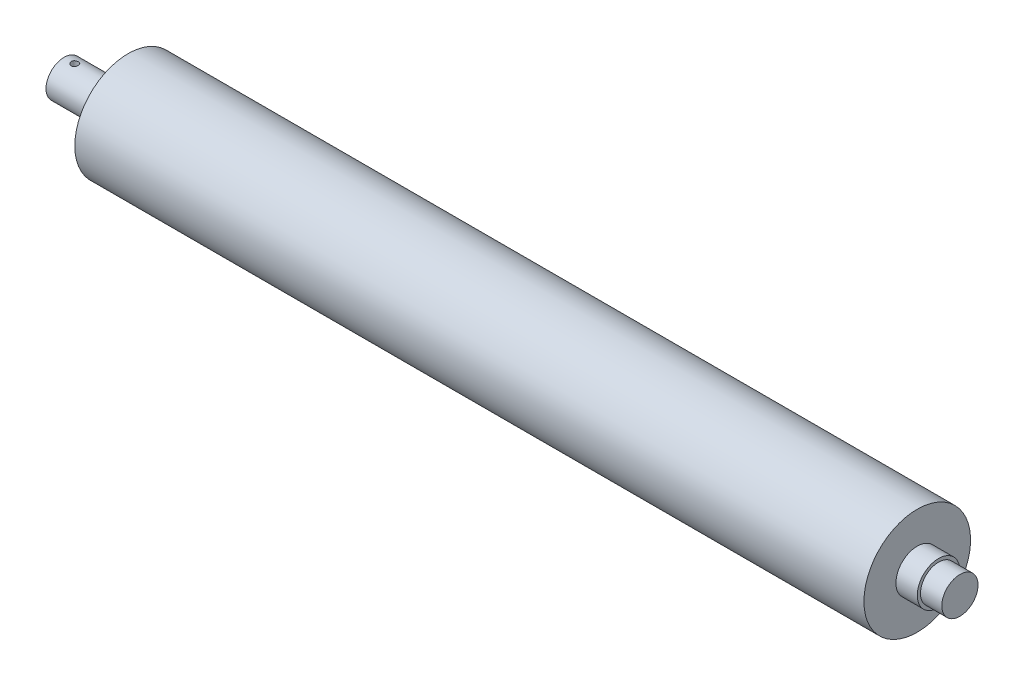
ISO-10303-21;
HEADER;
FILE_DESCRIPTION(('STEP AP214'),'2;1');
FILE_NAME('part.step','',(''),(''),'','','');
FILE_SCHEMA(('AUTOMOTIVE_DESIGN { 1 0 10303 214 1 1 1 1 }'));
ENDSEC;
DATA;
#1=APPLICATION_CONTEXT('core data for automotive mechanical design processes');
#2=APPLICATION_PROTOCOL_DEFINITION('international standard','automotive_design',2000,#1);
#3=PRODUCT_CONTEXT('',#1,'mechanical');
#4=PRODUCT('Part','Part','',(#3));
#5=PRODUCT_RELATED_PRODUCT_CATEGORY('part','',(#4));
#6=PRODUCT_DEFINITION_FORMATION('','',#4);
#7=PRODUCT_DEFINITION_CONTEXT('part definition',#1,'design');
#8=PRODUCT_DEFINITION('design','',#6,#7);
#9=PRODUCT_DEFINITION_SHAPE('','',#8);
#10=(LENGTH_UNIT() NAMED_UNIT(*) SI_UNIT(.MILLI.,.METRE.));
#11=(NAMED_UNIT(*) PLANE_ANGLE_UNIT() SI_UNIT($,.RADIAN.));
#12=(NAMED_UNIT(*) SI_UNIT($,.STERADIAN.) SOLID_ANGLE_UNIT());
#13=UNCERTAINTY_MEASURE_WITH_UNIT(LENGTH_MEASURE(1.E-05),#10,'distance_accuracy_value','');
#14=(GEOMETRIC_REPRESENTATION_CONTEXT(3) GLOBAL_UNCERTAINTY_ASSIGNED_CONTEXT((#13)) GLOBAL_UNIT_ASSIGNED_CONTEXT((#10,
#11,#12)) REPRESENTATION_CONTEXT('',''));
#15=CARTESIAN_POINT('',(0.,0.,0.));
#16=DIRECTION('',(0.,0.,1.));
#17=DIRECTION('',(1.,0.,0.));
#18=AXIS2_PLACEMENT_3D('',#15,#16,#17);
#19=CARTESIAN_POINT('',(-50.4921454977943,8.5,0.));
#20=DIRECTION('',(0.,1.,0.));
#21=DIRECTION('',(0.,0.,1.));
#22=AXIS2_PLACEMENT_3D('',#19,#20,#21);
#23=CYLINDRICAL_SURFACE('',#22,1.65);
#24=CARTESIAN_POINT('',(-50.4921454977943,-5.82065288434209,1.65));
#25=CARTESIAN_POINT('',(-50.4013334016638,-5.82065437726566,1.64999797266733));
#26=CARTESIAN_POINT('',(-50.3105001768433,-5.82280135853154,1.64247733745391));
#27=CARTESIAN_POINT('',(-50.1314626199643,-5.83113016096071,1.61265401651665));
#28=CARTESIAN_POINT('',(-50.0432595487459,-5.83731388574315,1.59034435661168));
#29=CARTESIAN_POINT('',(-49.8720983910363,-5.85296489134644,1.53173542085026));
#30=CARTESIAN_POINT('',(-49.7891329007997,-5.86242740862024,1.49545643167453));
#31=CARTESIAN_POINT('',(-49.630451550134,-5.88356367643304,1.41000281425575));
#32=CARTESIAN_POINT('',(-49.5547363479333,-5.89523762745442,1.36082701666865));
#33=CARTESIAN_POINT('',(-49.4107242703239,-5.919823649798,1.24959984442718));
#34=CARTESIAN_POINT('',(-49.3426451365785,-5.93275846998227,1.18727151640311));
#35=CARTESIAN_POINT('',(-49.2177650742963,-5.95821281321671,1.05210382992512));
#36=CARTESIAN_POINT('',(-49.1609653607867,-5.97073229140508,0.979263340551384));
#37=CARTESIAN_POINT('',(-49.0593420083028,-5.99419999295531,0.823622351656514));
#38=CARTESIAN_POINT('',(-49.0147358037853,-6.00511825629147,0.740674971429909));
#39=CARTESIAN_POINT('',(-48.9401853427932,-6.02389174814525,0.56811008326214));
#40=CARTESIAN_POINT('',(-48.9102384957627,-6.03174751780724,0.478493757063303));
#41=CARTESIAN_POINT('',(-48.8665642896858,-6.04335001683033,0.297408597032826));
#42=CARTESIAN_POINT('',(-48.8524663091581,-6.04719048557634,0.20603526176122));
#43=CARTESIAN_POINT('',(-48.8397229652666,-6.05065782490921,0.0221450586222227));
#44=CARTESIAN_POINT('',(-48.8410749012954,-6.05028543189399,-0.0703716065698035));
#45=CARTESIAN_POINT('',(-48.8589341363076,-6.04543727043666,-0.251339066772847));
#46=CARTESIAN_POINT('',(-48.8750408584455,-6.04106996420131,-0.339832745372549));
#47=CARTESIAN_POINT('',(-48.9213040633745,-6.02885133506642,-0.512810105386387));
#48=CARTESIAN_POINT('',(-48.9514613652555,-6.02099980905269,-0.597293552704396));
#49=CARTESIAN_POINT('',(-49.0252703472217,-6.00253597767466,-0.760862560584385));
#50=CARTESIAN_POINT('',(-49.0690572913508,-5.99189617598953,-0.83988385304074));
#51=CARTESIAN_POINT('',(-49.1687782814885,-5.96899916643194,-0.989592195527098));
#52=CARTESIAN_POINT('',(-49.2247147886028,-5.95674163105699,-1.06027755248529));
#53=CARTESIAN_POINT('',(-49.3492652924273,-5.93147082876596,-1.1936988236347));
#54=CARTESIAN_POINT('',(-49.4182283369292,-5.91844593226477,-1.25610708588062));
#55=CARTESIAN_POINT('',(-49.565775234419,-5.89346118650106,-1.36855483910386));
#56=CARTESIAN_POINT('',(-49.6443597305994,-5.88150140853396,-1.41859350249975));
#57=CARTESIAN_POINT('',(-49.8096553311947,-5.85995268779351,-1.505146553973));
#58=CARTESIAN_POINT('',(-49.896417404146,-5.85038018363885,-1.54156798699972));
#59=CARTESIAN_POINT('',(-50.0751603602464,-5.83489208999369,-1.59919814789971));
#60=CARTESIAN_POINT('',(-50.1671398735905,-5.82897554546203,-1.62041084896083));
#61=CARTESIAN_POINT('',(-50.3506328974553,-5.82167382701712,-1.64644839106137));
#62=CARTESIAN_POINT('',(-50.4420715032349,-5.82015310677883,-1.65176361969819));
#63=CARTESIAN_POINT('',(-50.6245317556906,-5.82144366322467,-1.64720965872124));
#64=CARTESIAN_POINT('',(-50.7155534479293,-5.82425445463477,-1.63734217007926));
#65=CARTESIAN_POINT('',(-50.8926801788368,-5.83376002307216,-1.60313601757953));
#66=CARTESIAN_POINT('',(-50.9788475604871,-5.84037465230273,-1.57909572270319));
#67=CARTESIAN_POINT('',(-51.145926108718,-5.85666346580151,-1.51756365022384));
#68=CARTESIAN_POINT('',(-51.2268365641098,-5.86633806300616,-1.48007005703384));
#69=CARTESIAN_POINT('',(-51.383146276778,-5.88793224772797,-1.39171164856937));
#70=CARTESIAN_POINT('',(-51.4583773297498,-5.89989808748098,-1.34056084134673));
#71=CARTESIAN_POINT('',(-51.599368169718,-5.92461939007576,-1.22669185784976));
#72=CARTESIAN_POINT('',(-51.6651260869045,-5.9373750080957,-1.16397140351164));
#73=CARTESIAN_POINT('',(-51.78735849814,-5.96270801523266,-1.0264686993013));
#74=CARTESIAN_POINT('',(-51.843490001572,-5.97526819769215,-0.951377732271553));
#75=CARTESIAN_POINT('',(-51.9423531963944,-5.99839852328391,-0.792556113257567));
#76=CARTESIAN_POINT('',(-51.9850856006549,-6.00896877227431,-0.708825921219671));
#77=CARTESIAN_POINT('',(-52.0555392706781,-6.02686010547745,-0.535691571967097));
#78=CARTESIAN_POINT('',(-52.0833734771249,-6.03420555757738,-0.446336014569963));
#79=CARTESIAN_POINT('',(-52.1235631455939,-6.04492706202133,-0.263984451195097));
#80=CARTESIAN_POINT('',(-52.135922208004,-6.04830403764465,-0.170989297186196));
#81=CARTESIAN_POINT('',(-52.144576629894,-6.05066228092608,0.012803691650227));
#82=CARTESIAN_POINT('',(-52.1413740362317,-6.04978093494039,0.103576450235713));
#83=CARTESIAN_POINT('',(-52.1201677427534,-6.04403453816205,0.283240435100883));
#84=CARTESIAN_POINT('',(-52.102164644871,-6.03916964937939,0.37213173774823));
#85=CARTESIAN_POINT('',(-52.0521573904209,-6.02603224209617,0.544876237066535));
#86=CARTESIAN_POINT('',(-52.0202592297301,-6.01778554843525,0.628762212974493));
#87=CARTESIAN_POINT('',(-51.9434617141057,-5.99874485012135,0.790039106584792));
#88=CARTESIAN_POINT('',(-51.8985604728071,-5.98795047591681,0.867429079805306));
#89=CARTESIAN_POINT('',(-51.7955852966845,-5.96459366082427,1.01583754271497));
#90=CARTESIAN_POINT('',(-51.737181518114,-5.95199059126526,1.08662074753416));
#91=CARTESIAN_POINT('',(-51.6094791453891,-5.92659478123856,1.21755145812398));
#92=CARTESIAN_POINT('',(-51.540177644548,-5.91380199099462,1.27769611721632));
#93=CARTESIAN_POINT('',(-51.3907052182803,-5.88913058572092,1.38703362668079));
#94=CARTESIAN_POINT('',(-51.3103186748454,-5.87728021279129,1.43593867766728));
#95=CARTESIAN_POINT('',(-51.1421509581298,-5.8562422131557,1.51947186933332));
#96=CARTESIAN_POINT('',(-51.054374450233,-5.84705292250314,1.55410893738157));
#97=CARTESIAN_POINT('',(-50.8878506766165,-5.83359129729563,1.60382872267331));
#98=CARTESIAN_POINT('',(-50.8097941821677,-5.82877973492013,1.62110114345224));
#99=CARTESIAN_POINT('',(-50.6518789201014,-5.82231007140326,1.64418694868339));
#100=CARTESIAN_POINT('',(-50.5720203818379,-5.820651571223,1.65000178316512));
#101=CARTESIAN_POINT('',(-50.4921454977943,-5.82065288434209,1.65));
#102=B_SPLINE_CURVE_WITH_KNOTS('',3,(#24,#25,#26,#27,#28,#29,#30,#31,#32,#33,#34,#35,#36,#37,
#38,#39,#40,#41,#42,#43,#44,#45,#46,#47,#48,#49,#50,#51,#52,#53,#54,#55,#56,#57,#58,#59,#60,#61,
#62,#63,#64,#65,#66,#67,#68,#69,#70,#71,#72,#73,#74,#75,#76,#77,#78,#79,#80,#81,#82,#83,#84,#85,
#86,#87,#88,#89,#90,#91,#92,#93,#94,#95,#96,#97,#98,#99,#100,#101),.UNSPECIFIED.,.T.,.F.,(4,2,2,
2,2,2,2,2,2,2,2,2,2,2,2,2,2,2,2,2,2,2,2,2,2,2,2,2,2,2,2,2,2,2,2,2,2,2,4),(0.,0.272142421531167,
0.544413270870418,0.816290202520554,1.08819179357773,1.36652259700908,1.64488336618984,
1.92792471101544,2.21091601958311,2.48714227323167,2.76332024395223,3.0322155862423,
3.30112660596763,3.57279636684429,3.84452121057657,4.12496058552846,4.40541871805263,
4.68775782013688,4.97002313596155,5.24348672694926,5.5169196831054,5.78479206192071,
6.05270060500048,6.32673168038151,6.60081677019403,6.88323412344203,7.16563644873689,
7.44586646945045,7.72603128079755,7.99721863644499,8.26839496349792,8.53753793815438,
8.80671997712911,9.0833435593423,9.360041049309,9.643184993488,9.92615150656222,
10.1655479835946,10.4049141615528),.UNSPECIFIED.);
#103=CARTESIAN_POINT('',(-50.4921454977943,-5.82065288434209,1.65));
#104=VERTEX_POINT('',#103);
#105=EDGE_CURVE('E40',#104,#104,#102,.T.);
#106=ORIENTED_EDGE('',*,*,#105,.T.);
#107=EDGE_LOOP('',(#106));
#108=FACE_BOUND('',#107,.T.);
#109=CARTESIAN_POINT('',(-50.4921454977943,-8.33831517754036,1.65));
#110=CARTESIAN_POINT('',(-50.4004060032334,-8.33831698113515,1.64999654584405));
#111=CARTESIAN_POINT('',(-50.3086223841767,-8.33984562808622,1.64232299568276));
#112=CARTESIAN_POINT('',(-50.1276476156017,-8.34578672369094,1.6118547816225));
#113=CARTESIAN_POINT('',(-50.0384586632472,-8.35020154614159,1.58904767056989));
#114=CARTESIAN_POINT('',(-49.8653177982748,-8.36139657192924,1.52904282723213));
#115=CARTESIAN_POINT('',(-49.7813609254275,-8.36817449346442,1.49185897332863));
#116=CARTESIAN_POINT('',(-49.620880876314,-8.38332930931016,1.40419357245978));
#117=CARTESIAN_POINT('',(-49.544357206881,-8.39170609743209,1.35371290851684));
#118=CARTESIAN_POINT('',(-49.3998909628083,-8.40923952487649,1.24016959557929));
#119=CARTESIAN_POINT('',(-49.3320618751395,-8.41840428803623,1.1769637841096));
#120=CARTESIAN_POINT('',(-49.2079000277361,-8.43640940764748,1.04007371819241));
#121=CARTESIAN_POINT('',(-49.1515680491159,-8.44524974202383,0.966388752366983));
#122=CARTESIAN_POINT('',(-49.0515617196865,-8.46169727609052,0.809883405698844));
#123=CARTESIAN_POINT('',(-49.0079948126202,-8.46929378350957,0.726993148749954));
#124=CARTESIAN_POINT('',(-48.9354481258388,-8.48230663974867,0.554897288771806));
#125=CARTESIAN_POINT('',(-48.9064670603499,-8.48772318072911,0.465692243196042));
#126=CARTESIAN_POINT('',(-48.8642668849978,-8.49570841983847,0.284675958249799));
#127=CARTESIAN_POINT('',(-48.8508562893768,-8.4983116874139,0.192910910072457));
#128=CARTESIAN_POINT('',(-48.8395806801813,-8.50049633977488,0.00839893937519247));
#129=CARTESIAN_POINT('',(-48.841714251907,-8.5000779995619,-0.0843478930237897));
#130=CARTESIAN_POINT('',(-48.8613204027176,-8.49629346800802,-0.266876138201246));
#131=CARTESIAN_POINT('',(-48.8785867587345,-8.49296691012217,-0.35668064321074));
#132=CARTESIAN_POINT('',(-48.9276417004292,-8.4837842951796,-0.532092958251712));
#133=CARTESIAN_POINT('',(-48.959430842868,-8.47792814114607,-0.617700607248726));
#134=CARTESIAN_POINT('',(-49.0368226263648,-8.46427857123533,-0.782882145301342));
#135=CARTESIAN_POINT('',(-49.0825068457682,-8.45647376460302,-0.862416833091105));
#136=CARTESIAN_POINT('',(-49.18633173434,-8.43978859795565,-1.01276800571309));
#137=CARTESIAN_POINT('',(-49.2444737574475,-8.43090812108022,-1.08358354161201));
#138=CARTESIAN_POINT('',(-49.3726975773392,-8.41288167589598,-1.21570911700106));
#139=CARTESIAN_POINT('',(-49.4429598271598,-8.40373374274387,-1.27684389120401));
#140=CARTESIAN_POINT('',(-49.592830792031,-8.38634230598401,-1.3864897873232));
#141=CARTESIAN_POINT('',(-49.6724396639903,-8.37809881756435,-1.43500069726903));
#142=CARTESIAN_POINT('',(-49.8389865205909,-8.36344623555506,-1.51807723517798));
#143=CARTESIAN_POINT('',(-49.9259382979277,-8.35704069818365,-1.55261588065732));
#144=CARTESIAN_POINT('',(-50.1045635063928,-8.34684249822114,-1.60654321302851));
#145=CARTESIAN_POINT('',(-50.1962363593594,-8.34304951650001,-1.62593375033739));
#146=CARTESIAN_POINT('',(-50.380116812533,-8.3385694396991,-1.64875539263453));
#147=CARTESIAN_POINT('',(-50.4722919139398,-8.33783321457739,-1.65243897562144));
#148=CARTESIAN_POINT('',(-50.6559397897254,-8.33941832618164,-1.64442029839135));
#149=CARTESIAN_POINT('',(-50.7474126012217,-8.34173950018331,-1.63271885701324));
#150=CARTESIAN_POINT('',(-50.9262195881897,-8.34913198025222,-1.5944795198524));
#151=CARTESIAN_POINT('',(-51.0135834707284,-8.35417849398702,-1.56807530840784));
#152=CARTESIAN_POINT('',(-51.1826472581988,-8.36643148072363,-1.5013223658954));
#153=CARTESIAN_POINT('',(-51.2643467192243,-8.37363812277408,-1.46097254342549));
#154=CARTESIAN_POINT('',(-51.4208708848263,-8.38951045394444,-1.36689766709721));
#155=CARTESIAN_POINT('',(-51.4955984586043,-8.3981930294779,-1.31301390845285));
#156=CARTESIAN_POINT('',(-51.635042767909,-8.41599203300003,-1.19361344448673));
#157=CARTESIAN_POINT('',(-51.6997585344433,-8.42510850287163,-1.12809561447807));
#158=CARTESIAN_POINT('',(-51.8182927440228,-8.44290679899299,-0.986156152541234));
#159=CARTESIAN_POINT('',(-51.8719409096963,-8.45158047945517,-0.909591136547651));
#160=CARTESIAN_POINT('',(-51.9656121558562,-8.46737647548225,-0.748388224061675));
#161=CARTESIAN_POINT('',(-52.0056357864847,-8.47449885368268,-0.66375065370593));
#162=CARTESIAN_POINT('',(-52.0706704326536,-8.4863548446495,-0.489263714493164));
#163=CARTESIAN_POINT('',(-52.0957632202455,-8.49110144571434,-0.399445745153133));
#164=CARTESIAN_POINT('',(-52.1304839022612,-8.49772663424996,-0.216768885986863));
#165=CARTESIAN_POINT('',(-52.1401135463944,-8.49960554620872,-0.123910341425969));
#166=CARTESIAN_POINT('',(-52.1435700957032,-8.50027656489904,0.0605822198027712));
#167=CARTESIAN_POINT('',(-52.1376535617328,-8.49911878713466,0.152211345149112));
#168=CARTESIAN_POINT('',(-52.1107499997384,-8.49395129578558,0.333143326460724));
#169=CARTESIAN_POINT('',(-52.0897631391383,-8.48994161388417,0.422446208258011));
#170=CARTESIAN_POINT('',(-52.0334258968924,-8.47952157392228,0.596042436980435));
#171=CARTESIAN_POINT('',(-51.9981046662415,-8.47311609012788,0.680345555197925));
#172=CARTESIAN_POINT('',(-51.9141329351479,-8.45859591220442,0.841866215165835));
#173=CARTESIAN_POINT('',(-51.8654814569904,-8.45048109271323,0.919083236627552));
#174=CARTESIAN_POINT('',(-51.7553563611809,-8.4332797058631,1.06551314009846));
#175=CARTESIAN_POINT('',(-51.69369832247,-8.42418019390968,1.13458582031064));
#176=CARTESIAN_POINT('',(-51.5596911081936,-8.40611415030437,1.26149270349594));
#177=CARTESIAN_POINT('',(-51.4873394133871,-8.39714765053707,1.31932425079926));
#178=CARTESIAN_POINT('',(-51.33312863321,-8.38026411985667,1.42265582279924));
#179=CARTESIAN_POINT('',(-51.2511814188988,-8.37235852454963,1.46802626325658));
#180=CARTESIAN_POINT('',(-51.0806983024914,-8.35863054933975,1.54428259370771));
#181=CARTESIAN_POINT('',(-50.9921685818599,-8.35280624406743,1.57518187900865));
#182=CARTESIAN_POINT('',(-50.8348649443688,-8.34508778751033,1.61548885886861));
#183=CARTESIAN_POINT('',(-50.7669998553561,-8.3425634825758,1.62840785060948));
#184=CARTESIAN_POINT('',(-50.6301466438871,-8.33917652483707,1.64566458797864));
#185=CARTESIAN_POINT('',(-50.5611585561591,-8.3383138207464,1.650002598465));
#186=CARTESIAN_POINT('',(-50.4921454977943,-8.33831517754036,1.65));
#187=B_SPLINE_CURVE_WITH_KNOTS('',3,(#109,#110,#111,#112,#113,#114,#115,#116,#117,#118,#119,
#120,#121,#122,#123,#124,#125,#126,#127,#128,#129,#130,#131,#132,#133,#134,#135,#136,#137,#138,
#139,#140,#141,#142,#143,#144,#145,#146,#147,#148,#149,#150,#151,#152,#153,#154,#155,#156,#157,
#158,#159,#160,#161,#162,#163,#164,#165,#166,#167,#168,#169,#170,#171,#172,#173,#174,#175,#176,
#177,#178,#179,#180,#181,#182,#183,#184,#185,#186),.UNSPECIFIED.,.T.,.F.,(4,2,2,2,2,2,2,2,2,2,2,
2,2,2,2,2,2,2,2,2,2,2,2,2,2,2,2,2,2,2,2,2,2,2,2,2,2,2,4),(0.,0.274965859741973,
0.550158156059082,0.825085460062391,1.0999945111318,1.37818912456829,1.65640263228317,
1.93689469309254,2.21736202357957,2.49434235517784,2.7712974786621,3.04453605613445,
3.31778510964989,3.59267043854047,3.86758565768952,4.1470171225601,4.42645327913081,
4.70642652086172,4.98636555711355,5.26178739990557,5.53719458448327,5.81013759309057,
6.08310196741856,6.35943028424879,6.63578532879905,6.91611850976486,7.19644036987439,
7.47521250706604,7.75395309797953,8.02812259654215,8.30228904926175,8.57590071708917,
8.84953245849944,9.12734186132845,9.40521681589057,9.68588052782289,9.96628392578407,
10.1731394437882,10.3799885769506),.UNSPECIFIED.);
#188=CARTESIAN_POINT('',(-50.4921454977943,-8.33831517754036,1.65));
#189=VERTEX_POINT('',#188);
#190=EDGE_CURVE('E73',#189,#189,#187,.T.);
#191=ORIENTED_EDGE('',*,*,#190,.F.);
#192=EDGE_LOOP('',(#191));
#193=FACE_BOUND('',#192,.T.);
#194=ADVANCED_FACE('F36',(#108,#193),#23,.F.);
#195=CARTESIAN_POINT('',(-55.4921454977944,8.5,0.));
#196=DIRECTION('',(1.,0.,0.));
#197=DIRECTION('',(0.,0.,-1.));
#198=AXIS2_PLACEMENT_3D('',#195,#196,#197);
#199=PLANE('',#198);
#200=CARTESIAN_POINT('',(-55.4921454977944,0.,0.));
#201=DIRECTION('',(-1.,0.,0.));
#202=DIRECTION('',(0.,0.,1.));
#203=AXIS2_PLACEMENT_3D('',#200,#201,#202);
#204=CIRCLE('',#203,6.04999999999999);
#205=CARTESIAN_POINT('',(-55.4921454977944,0.,6.04999999999999));
#206=VERTEX_POINT('',#205);
#207=EDGE_CURVE('E63',#206,#206,#204,.T.);
#208=ORIENTED_EDGE('',*,*,#207,.F.);
#209=EDGE_LOOP('',(#208));
#210=FACE_BOUND('',#209,.T.);
#211=CARTESIAN_POINT('',(-55.4921454977944,0.,0.));
#212=DIRECTION('',(-1.,0.,0.));
#213=DIRECTION('',(0.,0.,1.));
#214=AXIS2_PLACEMENT_3D('',#211,#212,#213);
#215=CIRCLE('',#214,8.5);
#216=CARTESIAN_POINT('',(-55.4921454977944,0.,8.5));
#217=VERTEX_POINT('',#216);
#218=EDGE_CURVE('E49',#217,#217,#215,.T.);
#219=ORIENTED_EDGE('',*,*,#218,.T.);
#220=EDGE_LOOP('',(#219));
#221=FACE_BOUND('',#220,.T.);
#222=ADVANCED_FACE('F38',(#210,#221),#199,.F.);
#223=CARTESIAN_POINT('',(-62.7058823529411,0.,0.));
#224=DIRECTION('',(-1.,0.,0.));
#225=DIRECTION('',(0.,0.,1.));
#226=AXIS2_PLACEMENT_3D('',#223,#224,#225);
#227=CYLINDRICAL_SURFACE('',#226,8.5);
#228=ORIENTED_EDGE('',*,*,#190,.T.);
#229=EDGE_LOOP('',(#228));
#230=FACE_BOUND('',#229,.T.);
#231=CARTESIAN_POINT('',(-50.4921454977943,8.33831517754036,1.65));
#232=CARTESIAN_POINT('',(-50.5838849923553,8.33831698113515,1.64999654584405));
#233=CARTESIAN_POINT('',(-50.675668611412,8.33984562808622,1.64232299568276));
#234=CARTESIAN_POINT('',(-50.856643379987,8.34578672369094,1.6118547816225));
#235=CARTESIAN_POINT('',(-50.9458323323415,8.35020154614159,1.58904767056989));
#236=CARTESIAN_POINT('',(-51.1189731973139,8.36139657192924,1.52904282723213));
#237=CARTESIAN_POINT('',(-51.2029300701612,8.36817449346442,1.49185897332863));
#238=CARTESIAN_POINT('',(-51.3634101192747,8.38332930931016,1.40419357245978));
#239=CARTESIAN_POINT('',(-51.4399337887077,8.39170609743209,1.35371290851684));
#240=CARTESIAN_POINT('',(-51.5844000327804,8.40923952487649,1.24016959557929));
#241=CARTESIAN_POINT('',(-51.6522291204492,8.41840428803623,1.1769637841096));
#242=CARTESIAN_POINT('',(-51.7763909678526,8.43640940764748,1.04007371819241));
#243=CARTESIAN_POINT('',(-51.8327229464728,8.44524974202383,0.966388752366983));
#244=CARTESIAN_POINT('',(-51.9327292759022,8.46169727609052,0.809883405698842));
#245=CARTESIAN_POINT('',(-51.9762961829685,8.46929378350957,0.726993148749949));
#246=CARTESIAN_POINT('',(-52.0488428697499,8.48230663974867,0.554897288771801));
#247=CARTESIAN_POINT('',(-52.0778239352388,8.48772318072911,0.46569224319604));
#248=CARTESIAN_POINT('',(-52.1200241105909,8.49570841983847,0.284675958249799));
#249=CARTESIAN_POINT('',(-52.1334347062119,8.4983116874139,0.192910910072457));
#250=CARTESIAN_POINT('',(-52.1447103154074,8.50049633977488,0.0083989393751924));
#251=CARTESIAN_POINT('',(-52.1425767436817,8.5000779995619,-0.0843478930237897));
#252=CARTESIAN_POINT('',(-52.1229705928711,8.49629346800802,-0.266876138201246));
#253=CARTESIAN_POINT('',(-52.1057042368542,8.49296691012217,-0.35668064321074));
#254=CARTESIAN_POINT('',(-52.0566492951595,8.4837842951796,-0.532092958251712));
#255=CARTESIAN_POINT('',(-52.0248601527207,8.47792814114607,-0.617700607248726));
#256=CARTESIAN_POINT('',(-51.9474683692239,8.46427857123533,-0.782882145301341));
#257=CARTESIAN_POINT('',(-51.9017841498205,8.45647376460302,-0.862416833091103));
#258=CARTESIAN_POINT('',(-51.7979592612487,8.43978859795565,-1.01276800571309));
#259=CARTESIAN_POINT('',(-51.7398172381411,8.43090812108022,-1.08358354161201));
#260=CARTESIAN_POINT('',(-51.6115934182495,8.41288167589598,-1.21570911700106));
#261=CARTESIAN_POINT('',(-51.5413311684289,8.40373374274387,-1.27684389120401));
#262=CARTESIAN_POINT('',(-51.3914602035577,8.38634230598401,-1.3864897873232));
#263=CARTESIAN_POINT('',(-51.3118513315984,8.37809881756435,-1.43500069726903));
#264=CARTESIAN_POINT('',(-51.1453044749978,8.36344623555506,-1.51807723517797));
#265=CARTESIAN_POINT('',(-51.058352697661,8.35704069818365,-1.55261588065732));
#266=CARTESIAN_POINT('',(-50.8797274891959,8.34684249822114,-1.60654321302851));
#267=CARTESIAN_POINT('',(-50.7880546362293,8.34304951650001,-1.62593375033739));
#268=CARTESIAN_POINT('',(-50.6041741830557,8.3385694396991,-1.64875539263453));
#269=CARTESIAN_POINT('',(-50.5119990816489,8.33783321457739,-1.65243897562144));
#270=CARTESIAN_POINT('',(-50.3283512058633,8.33941832618164,-1.64442029839135));
#271=CARTESIAN_POINT('',(-50.236878394367,8.34173950018331,-1.63271885701324));
#272=CARTESIAN_POINT('',(-50.058071407399,8.34913198025222,-1.5944795198524));
#273=CARTESIAN_POINT('',(-49.9707075248603,8.35417849398702,-1.56807530840784));
#274=CARTESIAN_POINT('',(-49.8016437373899,8.36643148072363,-1.5013223658954));
#275=CARTESIAN_POINT('',(-49.7199442763644,8.37363812277408,-1.46097254342549));
#276=CARTESIAN_POINT('',(-49.5634201107624,8.38951045394444,-1.36689766709721));
#277=CARTESIAN_POINT('',(-49.4886925369844,8.3981930294779,-1.31301390845285));
#278=CARTESIAN_POINT('',(-49.3492482276797,8.41599203300003,-1.19361344448673));
#279=CARTESIAN_POINT('',(-49.2845324611454,8.42510850287163,-1.12809561447807));
#280=CARTESIAN_POINT('',(-49.1659982515659,8.44290679899299,-0.986156152541234));
#281=CARTESIAN_POINT('',(-49.1123500858923,8.45158047945517,-0.909591136547648));
#282=CARTESIAN_POINT('',(-49.0186788397325,8.46737647548225,-0.748388224061672));
#283=CARTESIAN_POINT('',(-48.978655209104,8.47449885368268,-0.663750653705929));
#284=CARTESIAN_POINT('',(-48.9136205629351,8.4863548446495,-0.489263714493165));
#285=CARTESIAN_POINT('',(-48.8885277753432,8.49110144571434,-0.399445745153133));
#286=CARTESIAN_POINT('',(-48.8538070933275,8.49772663424996,-0.216768885986863));
#287=CARTESIAN_POINT('',(-48.8441774491943,8.49960554620872,-0.123910341425969));
#288=CARTESIAN_POINT('',(-48.8407208998855,8.50027656489904,0.0605822198027713));
#289=CARTESIAN_POINT('',(-48.8466374338559,8.49911878713466,0.152211345149112));
#290=CARTESIAN_POINT('',(-48.8735409958503,8.49395129578558,0.333143326460723));
#291=CARTESIAN_POINT('',(-48.8945278564504,8.48994161388417,0.422446208258011));
#292=CARTESIAN_POINT('',(-48.9508650986963,8.47952157392228,0.596042436980432));
#293=CARTESIAN_POINT('',(-48.9861863293472,8.47311609012787,0.68034555519792));
#294=CARTESIAN_POINT('',(-49.0701580604408,8.45859591220442,0.84186621516583));
#295=CARTESIAN_POINT('',(-49.1188095385983,8.45048109271323,0.919083236627549));
#296=CARTESIAN_POINT('',(-49.2289346344078,8.4332797058631,1.06551314009846));
#297=CARTESIAN_POINT('',(-49.2905926731187,8.42418019390968,1.13458582031064));
#298=CARTESIAN_POINT('',(-49.4245998873951,8.40611415030437,1.26149270349594));
#299=CARTESIAN_POINT('',(-49.4969515822016,8.39714765053707,1.31932425079926));
#300=CARTESIAN_POINT('',(-49.6511623623787,8.38026411985667,1.42265582279924));
#301=CARTESIAN_POINT('',(-49.7331095766899,8.37235852454963,1.46802626325658));
#302=CARTESIAN_POINT('',(-49.9035926930973,8.35863054933975,1.54428259370771));
#303=CARTESIAN_POINT('',(-49.9921224137288,8.35280624406743,1.57518187900865));
#304=CARTESIAN_POINT('',(-50.1494260512199,8.34508778751033,1.61548885886861));
#305=CARTESIAN_POINT('',(-50.2172911402326,8.3425634825758,1.62840785060948));
#306=CARTESIAN_POINT('',(-50.3541443517016,8.33917652483707,1.64566458797864));
#307=CARTESIAN_POINT('',(-50.4231324394296,8.3383138207464,1.650002598465));
#308=CARTESIAN_POINT('',(-50.4921454977943,8.33831517754036,1.65));
#309=B_SPLINE_CURVE_WITH_KNOTS('',3,(#231,#232,#233,#234,#235,#236,#237,#238,#239,#240,#241,
#242,#243,#244,#245,#246,#247,#248,#249,#250,#251,#252,#253,#254,#255,#256,#257,#258,#259,#260,
#261,#262,#263,#264,#265,#266,#267,#268,#269,#270,#271,#272,#273,#274,#275,#276,#277,#278,#279,
#280,#281,#282,#283,#284,#285,#286,#287,#288,#289,#290,#291,#292,#293,#294,#295,#296,#297,#298,
#299,#300,#301,#302,#303,#304,#305,#306,#307,#308),.UNSPECIFIED.,.T.,.F.,(4,2,2,2,2,2,2,2,2,2,2,
2,2,2,2,2,2,2,2,2,2,2,2,2,2,2,2,2,2,2,2,2,2,2,2,2,2,2,4),(0.,0.274965859741973,
0.550158156059082,0.825085460062391,1.0999945111318,1.37818912456829,1.65640263228317,
1.93689469309255,2.21736202357957,2.49434235517784,2.7712974786621,3.04453605613445,
3.31778510964989,3.59267043854047,3.86758565768952,4.14701712256009,4.42645327913081,
4.70642652086171,4.98636555711355,5.26178739990558,5.53719458448327,5.81013759309057,
6.08310196741856,6.35943028424879,6.63578532879905,6.91611850976486,7.19644036987439,
7.47521250706604,7.75395309797953,8.02812259654215,8.30228904926175,8.57590071708916,
8.84953245849944,9.12734186132845,9.40521681589057,9.68588052782289,9.96628392578407,
10.1731394437882,10.3799885769506),.UNSPECIFIED.);
#310=CARTESIAN_POINT('',(-50.4921454977943,8.33831517754036,1.65));
#311=VERTEX_POINT('',#310);
#312=EDGE_CURVE('E11',#311,#311,#309,.T.);
#313=ORIENTED_EDGE('',*,*,#312,.T.);
#314=EDGE_LOOP('',(#313));
#315=FACE_BOUND('',#314,.T.);
#316=ORIENTED_EDGE('',*,*,#218,.F.);
#317=EDGE_LOOP('',(#316));
#318=FACE_BOUND('',#317,.T.);
#319=CARTESIAN_POINT('',(-35.4921454977943,0.,0.));
#320=DIRECTION('',(-1.,0.,0.));
#321=DIRECTION('',(0.,0.,1.));
#322=AXIS2_PLACEMENT_3D('',#319,#320,#321);
#323=CIRCLE('',#322,8.5);
#324=CARTESIAN_POINT('',(-35.4921454977943,0.,8.5));
#325=VERTEX_POINT('',#324);
#326=EDGE_CURVE('E94',#325,#325,#323,.T.);
#327=ORIENTED_EDGE('',*,*,#326,.T.);
#328=EDGE_LOOP('',(#327));
#329=FACE_BOUND('',#328,.T.);
#330=ADVANCED_FACE('F105',(#230,#315,#318,#329),#227,.T.);
#331=CARTESIAN_POINT('',(-35.4921454977943,9.99999999999995,0.));
#332=DIRECTION('',(1.,0.,0.));
#333=DIRECTION('',(0.,0.,-1.));
#334=AXIS2_PLACEMENT_3D('',#331,#332,#333);
#335=PLANE('',#334);
#336=ORIENTED_EDGE('',*,*,#326,.F.);
#337=EDGE_LOOP('',(#336));
#338=FACE_BOUND('',#337,.T.);
#339=CARTESIAN_POINT('',(-35.4921454977943,0.,0.));
#340=DIRECTION('',(-1.,0.,0.));
#341=DIRECTION('',(0.,0.,1.));
#342=AXIS2_PLACEMENT_3D('',#339,#340,#341);
#343=CIRCLE('',#342,9.99999999999995);
#344=CARTESIAN_POINT('',(-35.4921454977943,0.,9.99999999999995));
#345=VERTEX_POINT('',#344);
#346=EDGE_CURVE('E91',#345,#345,#343,.T.);
#347=ORIENTED_EDGE('',*,*,#346,.T.);
#348=EDGE_LOOP('',(#347));
#349=FACE_BOUND('',#348,.T.);
#350=ADVANCED_FACE('F142',(#338,#349),#335,.F.);
#351=CARTESIAN_POINT('',(-62.7058823529411,0.,0.));
#352=DIRECTION('',(-1.,0.,0.));
#353=DIRECTION('',(0.,0.,1.));
#354=AXIS2_PLACEMENT_3D('',#351,#352,#353);
#355=CYLINDRICAL_SURFACE('',#354,9.99999999999995);
#356=ORIENTED_EDGE('',*,*,#346,.F.);
#357=EDGE_LOOP('',(#356));
#358=FACE_BOUND('',#357,.T.);
#359=CARTESIAN_POINT('',(-25.4921454977943,0.,0.));
#360=DIRECTION('',(-1.,0.,0.));
#361=DIRECTION('',(0.,0.,1.));
#362=AXIS2_PLACEMENT_3D('',#359,#360,#361);
#363=CIRCLE('',#362,9.99999999999995);
#364=CARTESIAN_POINT('',(-25.4921454977943,0.,9.99999999999995));
#365=VERTEX_POINT('',#364);
#366=EDGE_CURVE('E88',#365,#365,#363,.T.);
#367=ORIENTED_EDGE('',*,*,#366,.T.);
#368=EDGE_LOOP('',(#367));
#369=FACE_BOUND('',#368,.T.);
#370=ADVANCED_FACE('F151',(#358,#369),#355,.T.);
#371=CARTESIAN_POINT('',(-25.4921454977943,25.,0.));
#372=DIRECTION('',(1.,0.,0.));
#373=DIRECTION('',(0.,0.,-1.));
#374=AXIS2_PLACEMENT_3D('',#371,#372,#373);
#375=PLANE('',#374);
#376=ORIENTED_EDGE('',*,*,#366,.F.);
#377=EDGE_LOOP('',(#376));
#378=FACE_BOUND('',#377,.T.);
#379=CARTESIAN_POINT('',(-25.4921454977943,0.,0.));
#380=DIRECTION('',(-1.,0.,0.));
#381=DIRECTION('',(0.,0.,1.));
#382=AXIS2_PLACEMENT_3D('',#379,#380,#381);
#383=CIRCLE('',#382,25.);
#384=CARTESIAN_POINT('',(-25.4921454977943,0.,25.));
#385=VERTEX_POINT('',#384);
#386=EDGE_CURVE('E85',#385,#385,#383,.T.);
#387=ORIENTED_EDGE('',*,*,#386,.T.);
#388=EDGE_LOOP('',(#387));
#389=FACE_BOUND('',#388,.T.);
#390=ADVANCED_FACE('F156',(#378,#389),#375,.F.);
#391=CARTESIAN_POINT('',(-62.7058823529411,0.,0.));
#392=DIRECTION('',(-1.,0.,0.));
#393=DIRECTION('',(0.,0.,1.));
#394=AXIS2_PLACEMENT_3D('',#391,#392,#393);
#395=CYLINDRICAL_SURFACE('',#394,25.);
#396=ORIENTED_EDGE('',*,*,#386,.F.);
#397=EDGE_LOOP('',(#396));
#398=FACE_BOUND('',#397,.T.);
#399=CARTESIAN_POINT('',(344.507854502206,0.,0.));
#400=DIRECTION('',(-1.,0.,0.));
#401=DIRECTION('',(0.,0.,1.));
#402=AXIS2_PLACEMENT_3D('',#399,#400,#401);
#403=CIRCLE('',#402,25.);
#404=CARTESIAN_POINT('',(344.507854502206,0.,25.));
#405=VERTEX_POINT('',#404);
#406=EDGE_CURVE('E82',#405,#405,#403,.T.);
#407=ORIENTED_EDGE('',*,*,#406,.T.);
#408=EDGE_LOOP('',(#407));
#409=FACE_BOUND('',#408,.T.);
#410=ADVANCED_FACE('F162',(#398,#409),#395,.T.);
#411=CARTESIAN_POINT('',(344.507854502206,10.,0.));
#412=DIRECTION('',(-1.,0.,0.));
#413=DIRECTION('',(0.,0.,1.));
#414=AXIS2_PLACEMENT_3D('',#411,#412,#413);
#415=PLANE('',#414);
#416=ORIENTED_EDGE('',*,*,#406,.F.);
#417=EDGE_LOOP('',(#416));
#418=FACE_BOUND('',#417,.T.);
#419=CARTESIAN_POINT('',(344.507854502206,0.,0.));
#420=DIRECTION('',(-1.,0.,0.));
#421=DIRECTION('',(0.,0.,1.));
#422=AXIS2_PLACEMENT_3D('',#419,#420,#421);
#423=CIRCLE('',#422,10.);
#424=CARTESIAN_POINT('',(344.507854502206,0.,10.));
#425=VERTEX_POINT('',#424);
#426=EDGE_CURVE('E79',#425,#425,#423,.T.);
#427=ORIENTED_EDGE('',*,*,#426,.T.);
#428=EDGE_LOOP('',(#427));
#429=FACE_BOUND('',#428,.T.);
#430=ADVANCED_FACE('F168',(#418,#429),#415,.F.);
#431=CARTESIAN_POINT('',(-62.7058823529411,0.,0.));
#432=DIRECTION('',(-1.,0.,0.));
#433=DIRECTION('',(0.,0.,1.));
#434=AXIS2_PLACEMENT_3D('',#431,#432,#433);
#435=CYLINDRICAL_SURFACE('',#434,10.);
#436=ORIENTED_EDGE('',*,*,#426,.F.);
#437=EDGE_LOOP('',(#436));
#438=FACE_BOUND('',#437,.T.);
#439=CARTESIAN_POINT('',(354.507854502206,0.,0.));
#440=DIRECTION('',(-1.,0.,0.));
#441=DIRECTION('',(0.,0.,1.));
#442=AXIS2_PLACEMENT_3D('',#439,#440,#441);
#443=CIRCLE('',#442,10.);
#444=CARTESIAN_POINT('',(354.507854502206,0.,10.));
#445=VERTEX_POINT('',#444);
#446=EDGE_CURVE('E76',#445,#445,#443,.T.);
#447=ORIENTED_EDGE('',*,*,#446,.T.);
#448=EDGE_LOOP('',(#447));
#449=FACE_BOUND('',#448,.T.);
#450=ADVANCED_FACE('F174',(#438,#449),#435,.T.);
#451=CARTESIAN_POINT('',(354.507854502206,10.,0.));
#452=DIRECTION('',(-1.,0.,0.));
#453=DIRECTION('',(0.,0.,1.));
#454=AXIS2_PLACEMENT_3D('',#451,#452,#453);
#455=PLANE('',#454);
#456=ORIENTED_EDGE('',*,*,#446,.F.);
#457=EDGE_LOOP('',(#456));
#458=FACE_BOUND('',#457,.T.);
#459=CARTESIAN_POINT('',(354.507854502206,0.,0.));
#460=DIRECTION('',(-1.,0.,0.));
#461=DIRECTION('',(0.,0.,1.));
#462=AXIS2_PLACEMENT_3D('',#459,#460,#461);
#463=CIRCLE('',#462,8.50000000000005);
#464=CARTESIAN_POINT('',(354.507854502206,0.,8.50000000000005));
#465=VERTEX_POINT('',#464);
#466=EDGE_CURVE('E72',#465,#465,#463,.T.);
#467=ORIENTED_EDGE('',*,*,#466,.T.);
#468=EDGE_LOOP('',(#467));
#469=FACE_BOUND('',#468,.T.);
#470=ADVANCED_FACE('F180',(#458,#469),#455,.F.);
#471=CARTESIAN_POINT('',(-62.7058823529411,0.,0.));
#472=DIRECTION('',(-1.,0.,0.));
#473=DIRECTION('',(0.,0.,1.));
#474=AXIS2_PLACEMENT_3D('',#471,#472,#473);
#475=CYLINDRICAL_SURFACE('',#474,8.50000000000005);
#476=ORIENTED_EDGE('',*,*,#466,.F.);
#477=EDGE_LOOP('',(#476));
#478=FACE_BOUND('',#477,.T.);
#479=CARTESIAN_POINT('',(364.507854502206,0.,0.));
#480=DIRECTION('',(-1.,0.,0.));
#481=DIRECTION('',(0.,0.,1.));
#482=AXIS2_PLACEMENT_3D('',#479,#480,#481);
#483=CIRCLE('',#482,8.50000000000005);
#484=CARTESIAN_POINT('',(364.507854502206,0.,8.50000000000005));
#485=VERTEX_POINT('',#484);
#486=EDGE_CURVE('E69',#485,#485,#483,.T.);
#487=ORIENTED_EDGE('',*,*,#486,.T.);
#488=EDGE_LOOP('',(#487));
#489=FACE_BOUND('',#488,.T.);
#490=ADVANCED_FACE('F186',(#478,#489),#475,.T.);
#491=CARTESIAN_POINT('',(364.507854502206,8.50000000000005,0.));
#492=DIRECTION('',(-1.,0.,0.));
#493=DIRECTION('',(0.,0.,1.));
#494=AXIS2_PLACEMENT_3D('',#491,#492,#493);
#495=PLANE('',#494);
#496=ORIENTED_EDGE('',*,*,#486,.F.);
#497=EDGE_LOOP('',(#496));
#498=FACE_BOUND('',#497,.T.);
#499=ADVANCED_FACE('F112',(#498),#495,.F.);
#500=CARTESIAN_POINT('',(-50.4921454977943,5.82065288434209,1.65));
#501=CARTESIAN_POINT('',(-50.5829575939249,5.82065437726566,1.64999797266733));
#502=CARTESIAN_POINT('',(-50.6737908187454,5.82280135853154,1.64247733745391));
#503=CARTESIAN_POINT('',(-50.8528283756244,5.83113016096071,1.61265401651665));
#504=CARTESIAN_POINT('',(-50.9410314468428,5.83731388574315,1.59034435661168));
#505=CARTESIAN_POINT('',(-51.1121926045524,5.85296489134644,1.53173542085026));
#506=CARTESIAN_POINT('',(-51.195158094789,5.86242740862024,1.49545643167453));
#507=CARTESIAN_POINT('',(-51.3538394454547,5.88356367643304,1.41000281425575));
#508=CARTESIAN_POINT('',(-51.4295546476554,5.89523762745442,1.36082701666865));
#509=CARTESIAN_POINT('',(-51.5735667252648,5.919823649798,1.24959984442717));
#510=CARTESIAN_POINT('',(-51.6416458590102,5.93275846998227,1.18727151640311));
#511=CARTESIAN_POINT('',(-51.7665259212924,5.95821281321671,1.05210382992512));
#512=CARTESIAN_POINT('',(-51.823325634802,5.97073229140508,0.979263340551382));
#513=CARTESIAN_POINT('',(-51.9249489872859,5.99419999295531,0.823622351656515));
#514=CARTESIAN_POINT('',(-51.9695551918034,6.00511825629147,0.740674971429909));
#515=CARTESIAN_POINT('',(-52.0441056527955,6.02389174814525,0.56811008326214));
#516=CARTESIAN_POINT('',(-52.074052499826,6.03174751780724,0.478493757063303));
#517=CARTESIAN_POINT('',(-52.1177267059029,6.04335001683033,0.297408597032826));
#518=CARTESIAN_POINT('',(-52.1318246864306,6.04719048557634,0.206035261761221));
#519=CARTESIAN_POINT('',(-52.1445680303221,6.05065782490921,0.022145058622223));
#520=CARTESIAN_POINT('',(-52.1432160942933,6.05028543189399,-0.0703716065698034));
#521=CARTESIAN_POINT('',(-52.1253568592811,6.04543727043666,-0.251339066772844));
#522=CARTESIAN_POINT('',(-52.1092501371432,6.04106996420131,-0.339832745372544));
#523=CARTESIAN_POINT('',(-52.0629869322142,6.02885133506642,-0.512810105386382));
#524=CARTESIAN_POINT('',(-52.0328296303332,6.02099980905269,-0.597293552704393));
#525=CARTESIAN_POINT('',(-51.959020648367,6.00253597767466,-0.760862560584384));
#526=CARTESIAN_POINT('',(-51.9152337042379,5.99189617598953,-0.839883853040738));
#527=CARTESIAN_POINT('',(-51.8155127141002,5.96899916643194,-0.989592195527097));
#528=CARTESIAN_POINT('',(-51.7595762069859,5.95674163105699,-1.06027755248529));
#529=CARTESIAN_POINT('',(-51.6350257031614,5.93147082876596,-1.1936988236347));
#530=CARTESIAN_POINT('',(-51.5660626586595,5.91844593226477,-1.25610708588062));
#531=CARTESIAN_POINT('',(-51.4185157611697,5.89346118650106,-1.36855483910386));
#532=CARTESIAN_POINT('',(-51.3399312649893,5.88150140853396,-1.41859350249975));
#533=CARTESIAN_POINT('',(-51.174635664394,5.85995268779351,-1.505146553973));
#534=CARTESIAN_POINT('',(-51.0878735914427,5.85038018363885,-1.54156798699972));
#535=CARTESIAN_POINT('',(-50.9091306353423,5.83489208999369,-1.59919814789971));
#536=CARTESIAN_POINT('',(-50.8171511219982,5.82897554546203,-1.62041084896083));
#537=CARTESIAN_POINT('',(-50.6336580981334,5.82167382701712,-1.64644839106137));
#538=CARTESIAN_POINT('',(-50.5422194923538,5.82015310677883,-1.65176361969819));
#539=CARTESIAN_POINT('',(-50.3597592398981,5.82144366322467,-1.64720965872124));
#540=CARTESIAN_POINT('',(-50.2687375476594,5.82425445463477,-1.63734217007926));
#541=CARTESIAN_POINT('',(-50.0916108167518,5.83376002307216,-1.60313601757953));
#542=CARTESIAN_POINT('',(-50.0054434351016,5.84037465230273,-1.57909572270319));
#543=CARTESIAN_POINT('',(-49.8383648868707,5.85666346580151,-1.51756365022384));
#544=CARTESIAN_POINT('',(-49.7574544314789,5.86633806300616,-1.48007005703384));
#545=CARTESIAN_POINT('',(-49.6011447188107,5.88793224772797,-1.39171164856937));
#546=CARTESIAN_POINT('',(-49.5259136658389,5.89989808748098,-1.34056084134673));
#547=CARTESIAN_POINT('',(-49.3849228258707,5.92461939007576,-1.22669185784976));
#548=CARTESIAN_POINT('',(-49.3191649086842,5.9373750080957,-1.16397140351164));
#549=CARTESIAN_POINT('',(-49.1969324974487,5.96270801523266,-1.0264686993013));
#550=CARTESIAN_POINT('',(-49.1408009940167,5.97526819769215,-0.951377732271555));
#551=CARTESIAN_POINT('',(-49.0419377991943,5.99839852328391,-0.79255611325757));
#552=CARTESIAN_POINT('',(-48.9992053949337,6.00896877227431,-0.708825921219672));
#553=CARTESIAN_POINT('',(-48.9287517249106,6.02686010547745,-0.535691571967096));
#554=CARTESIAN_POINT('',(-48.9009175184638,6.03420555757738,-0.446336014569963));
#555=CARTESIAN_POINT('',(-48.8607278499948,6.04492706202133,-0.263984451195097));
#556=CARTESIAN_POINT('',(-48.8483687875847,6.04830403764465,-0.170989297186196));
#557=CARTESIAN_POINT('',(-48.8397143656947,6.05066228092608,0.0128036916502271));
#558=CARTESIAN_POINT('',(-48.842916959357,6.04978093494039,0.103576450235713));
#559=CARTESIAN_POINT('',(-48.8641232528353,6.04403453816205,0.283240435100883));
#560=CARTESIAN_POINT('',(-48.8821263507177,6.03916964937939,0.37213173774823));
#561=CARTESIAN_POINT('',(-48.9321336051678,6.02603224209617,0.544876237066535));
#562=CARTESIAN_POINT('',(-48.9640317658586,6.01778554843525,0.628762212974493));
#563=CARTESIAN_POINT('',(-49.040829281483,5.99874485012135,0.790039106584792));
#564=CARTESIAN_POINT('',(-49.0857305227816,5.98795047591681,0.867429079805306));
#565=CARTESIAN_POINT('',(-49.1887056989042,5.96459366082427,1.01583754271497));
#566=CARTESIAN_POINT('',(-49.2471094774747,5.95199059126526,1.08662074753416));
#567=CARTESIAN_POINT('',(-49.3748118501996,5.92659478123856,1.21755145812398));
#568=CARTESIAN_POINT('',(-49.4441133510407,5.91380199099462,1.27769611721632));
#569=CARTESIAN_POINT('',(-49.5935857773084,5.88913058572092,1.38703362668079));
#570=CARTESIAN_POINT('',(-49.6739723207432,5.87728021279129,1.43593867766728));
#571=CARTESIAN_POINT('',(-49.8421400374589,5.8562422131557,1.51947186933332));
#572=CARTESIAN_POINT('',(-49.9299165453557,5.84705292250314,1.55410893738157));
#573=CARTESIAN_POINT('',(-50.0964403189722,5.83359129729563,1.60382872267331));
#574=CARTESIAN_POINT('',(-50.174496813421,5.82877973492013,1.62110114345224));
#575=CARTESIAN_POINT('',(-50.3324120754873,5.82231007140326,1.64418694868339));
#576=CARTESIAN_POINT('',(-50.4122706137508,5.820651571223,1.65000178316512));
#577=CARTESIAN_POINT('',(-50.4921454977943,5.82065288434209,1.65));
#578=B_SPLINE_CURVE_WITH_KNOTS('',3,(#500,#501,#502,#503,#504,#505,#506,#507,#508,#509,#510,
#511,#512,#513,#514,#515,#516,#517,#518,#519,#520,#521,#522,#523,#524,#525,#526,#527,#528,#529,
#530,#531,#532,#533,#534,#535,#536,#537,#538,#539,#540,#541,#542,#543,#544,#545,#546,#547,#548,
#549,#550,#551,#552,#553,#554,#555,#556,#557,#558,#559,#560,#561,#562,#563,#564,#565,#566,#567,
#568,#569,#570,#571,#572,#573,#574,#575,#576,#577),.UNSPECIFIED.,.T.,.F.,(4,2,2,2,2,2,2,2,2,2,2,
2,2,2,2,2,2,2,2,2,2,2,2,2,2,2,2,2,2,2,2,2,2,2,2,2,2,2,4),(0.,0.272142421531167,
0.544413270870418,0.816290202520554,1.08819179357773,1.36652259700908,1.64488336618984,
1.92792471101544,2.21091601958311,2.48714227323167,2.76332024395223,3.0322155862423,
3.30112660596763,3.57279636684429,3.84452121057657,4.12496058552846,4.40541871805263,
4.68775782013688,4.97002313596155,5.24348672694926,5.5169196831054,5.78479206192071,
6.05270060500048,6.32673168038151,6.60081677019403,6.88323412344203,7.16563644873689,
7.44586646945045,7.72603128079755,7.99721863644499,8.26839496349792,8.53753793815438,
8.80671997712911,9.0833435593423,9.360041049309,9.643184993488,9.92615150656222,
10.1655479835946,10.4049141615528),.UNSPECIFIED.);
#579=CARTESIAN_POINT('',(-50.4921454977943,5.82065288434209,1.65));
#580=VERTEX_POINT('',#579);
#581=EDGE_CURVE('E62',#580,#580,#578,.T.);
#582=ORIENTED_EDGE('',*,*,#581,.T.);
#583=EDGE_LOOP('',(#582));
#584=FACE_BOUND('',#583,.T.);
#585=ORIENTED_EDGE('',*,*,#312,.F.);
#586=EDGE_LOOP('',(#585));
#587=FACE_BOUND('',#586,.T.);
#588=ADVANCED_FACE('F108',(#584,#587),#23,.F.);
#589=CARTESIAN_POINT('',(-55.4921454977944,0.,0.));
#590=DIRECTION('',(-1.,0.,0.));
#591=DIRECTION('',(0.,0.,1.));
#592=AXIS2_PLACEMENT_3D('',#589,#590,#591);
#593=CYLINDRICAL_SURFACE('',#592,6.04999999999999);
#594=ORIENTED_EDGE('',*,*,#581,.F.);
#595=EDGE_LOOP('',(#594));
#596=FACE_BOUND('',#595,.T.);
#597=CARTESIAN_POINT('',(-43.4921454977944,0.,0.));
#598=DIRECTION('',(-1.,0.,0.));
#599=DIRECTION('',(0.,0.,1.));
#600=AXIS2_PLACEMENT_3D('',#597,#598,#599);
#601=CIRCLE('',#600,6.05);
#602=CARTESIAN_POINT('',(-43.4921454977944,0.,6.05));
#603=VERTEX_POINT('',#602);
#604=EDGE_CURVE('E60',#603,#603,#601,.T.);
#605=ORIENTED_EDGE('',*,*,#604,.F.);
#606=EDGE_LOOP('',(#605));
#607=FACE_BOUND('',#606,.T.);
#608=ORIENTED_EDGE('',*,*,#207,.T.);
#609=EDGE_LOOP('',(#608));
#610=FACE_BOUND('',#609,.T.);
#611=ORIENTED_EDGE('',*,*,#105,.F.);
#612=EDGE_LOOP('',(#611));
#613=FACE_BOUND('',#612,.T.);
#614=ADVANCED_FACE('F56',(#596,#607,#610,#613),#593,.F.);
#615=CARTESIAN_POINT('',(-43.4921454977944,0.,0.));
#616=DIRECTION('',(-1.,0.,0.));
#617=DIRECTION('',(0.,0.,1.));
#618=AXIS2_PLACEMENT_3D('',#615,#616,#617);
#619=CONICAL_SURFACE('',#618,6.05,1.02974425867665);
#620=CARTESIAN_POINT('',(-39.8569387526776,0.,0.));
#621=VERTEX_POINT('',#620);
#622=VERTEX_LOOP('',#621);
#623=FACE_BOUND('',#622,.T.);
#624=ORIENTED_EDGE('',*,*,#604,.T.);
#625=EDGE_LOOP('',(#624));
#626=FACE_BOUND('',#625,.T.);
#627=ADVANCED_FACE('F53',(#623,#626),#619,.F.);
#628=CLOSED_SHELL('',(#194,#222,#330,#350,#370,#390,#410,#430,#450,#470,#490,#499,#588,#614,#627));
#629=MANIFOLD_SOLID_BREP('B2',#628);
#630=ADVANCED_BREP_SHAPE_REPRESENTATION('',(#18,#629),#14);
#631=SHAPE_DEFINITION_REPRESENTATION(#9,#630);
ENDSEC;
END-ISO-10303-21;
